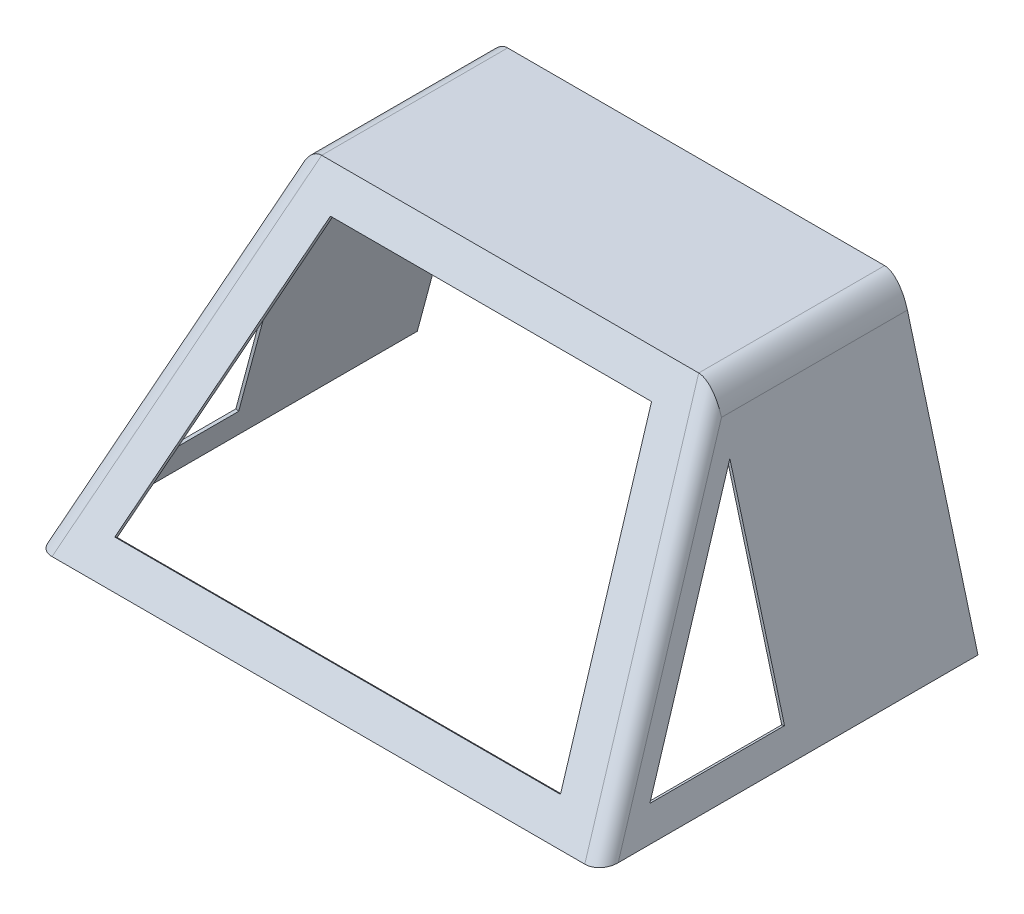
ISO-10303-21;
HEADER;
FILE_DESCRIPTION(('STEP AP214'),'2;1');
FILE_NAME('part.step','',(''),(''),'','','');
FILE_SCHEMA(('AUTOMOTIVE_DESIGN { 1 0 10303 214 1 1 1 1 }'));
ENDSEC;
DATA;
#1=APPLICATION_CONTEXT('core data for automotive mechanical design processes');
#2=APPLICATION_PROTOCOL_DEFINITION('international standard','automotive_design',2000,#1);
#3=PRODUCT_CONTEXT('',#1,'mechanical');
#4=PRODUCT('Part','Part','',(#3));
#5=PRODUCT_RELATED_PRODUCT_CATEGORY('part','',(#4));
#6=PRODUCT_DEFINITION_FORMATION('','',#4);
#7=PRODUCT_DEFINITION_CONTEXT('part definition',#1,'design');
#8=PRODUCT_DEFINITION('design','',#6,#7);
#9=PRODUCT_DEFINITION_SHAPE('','',#8);
#10=(LENGTH_UNIT() NAMED_UNIT(*) SI_UNIT(.MILLI.,.METRE.));
#11=(NAMED_UNIT(*) PLANE_ANGLE_UNIT() SI_UNIT($,.RADIAN.));
#12=(NAMED_UNIT(*) SI_UNIT($,.STERADIAN.) SOLID_ANGLE_UNIT());
#13=UNCERTAINTY_MEASURE_WITH_UNIT(LENGTH_MEASURE(1.E-05),#10,'distance_accuracy_value','');
#14=(GEOMETRIC_REPRESENTATION_CONTEXT(3) GLOBAL_UNCERTAINTY_ASSIGNED_CONTEXT((#13)) GLOBAL_UNIT_ASSIGNED_CONTEXT((#10,
#11,#12)) REPRESENTATION_CONTEXT('',''));
#15=CARTESIAN_POINT('',(0.,0.,0.));
#16=DIRECTION('',(0.,0.,1.));
#17=DIRECTION('',(1.,0.,0.));
#18=AXIS2_PLACEMENT_3D('',#15,#16,#17);
#19=CARTESIAN_POINT('',(-299.757495317995,30.6681449846779,147.146218744679));
#20=DIRECTION('',(-0.258819045102521,-0.965925826289068,0.));
#21=DIRECTION('',(0.965925826289068,-0.258819045102521,0.));
#22=AXIS2_PLACEMENT_3D('',#19,#20,#21);
#23=PLANE('',#22);
#24=DIRECTION('',(0.,0.,1.));
#25=VECTOR('',#24,1.);
#26=CARTESIAN_POINT('',(-296.690680819527,29.8463945164774,73.5731093723394));
#27=LINE('',#26,#25);
#28=CARTESIAN_POINT('',(-296.690680819527,29.8463945164774,0.));
#29=VERTEX_POINT('',#28);
#30=CARTESIAN_POINT('',(-296.690680819527,29.8463945164774,147.146218744679));
#31=VERTEX_POINT('',#30);
#32=EDGE_CURVE('E33',#29,#31,#27,.T.);
#33=ORIENTED_EDGE('',*,*,#32,.F.);
#34=DIRECTION('',(0.965925826289068,-0.258819045102521,0.));
#35=VECTOR('',#34,1.);
#36=CARTESIAN_POINT('',(-299.757495317995,30.6681449846779,0.));
#37=LINE('',#36,#35);
#38=CARTESIAN_POINT('',(-299.757495317995,30.6681449846779,0.));
#39=VERTEX_POINT('',#38);
#40=EDGE_CURVE('E578',#39,#29,#37,.T.);
#41=ORIENTED_EDGE('',*,*,#40,.F.);
#42=DIRECTION('',(0.,0.,-1.));
#43=VECTOR('',#42,1.);
#44=CARTESIAN_POINT('',(-299.757495317995,30.6681449846779,73.5731093723394));
#45=LINE('',#44,#43);
#46=CARTESIAN_POINT('',(-299.757495317995,30.6681449846779,147.146218744679));
#47=VERTEX_POINT('',#46);
#48=EDGE_CURVE('E580',#47,#39,#45,.T.);
#49=ORIENTED_EDGE('',*,*,#48,.F.);
#50=DIRECTION('',(0.965925826289068,-0.258819045102521,0.));
#51=VECTOR('',#50,1.);
#52=CARTESIAN_POINT('',(-299.757495317995,30.6681449846779,147.146218744679));
#53=LINE('',#52,#51);
#54=EDGE_CURVE('E9',#47,#31,#53,.T.);
#55=ORIENTED_EDGE('',*,*,#54,.T.);
#56=EDGE_LOOP('',(#33,#41,#49,#55));
#57=FACE_BOUND('',#56,.T.);
#58=ADVANCED_FACE('F15',(#57),#23,.F.);
#59=CARTESIAN_POINT('',(-240.018540042344,253.616961264494,0.));
#60=DIRECTION('',(0.139131791088288,0.519246913289549,0.843222976292653));
#61=DIRECTION('',(0.,-0.851504819811608,0.524346776320406));
#62=AXIS2_PLACEMENT_3D('',#59,#60,#61);
#63=PLANE('',#62);
#64=DIRECTION('',(0.21824216553257,0.814490850121409,-0.53756396108013));
#65=VECTOR('',#64,1.);
#66=CARTESIAN_POINT('',(-261.111096098265,162.631212408428,59.5082389359915));
#67=LINE('',#66,#65);
#68=CARTESIAN_POINT('',(-236.951725543876,252.795210796294,0.));
#69=VERTEX_POINT('',#68);
#70=EDGE_CURVE('E478',#31,#69,#67,.T.);
#71=ORIENTED_EDGE('',*,*,#70,.F.);
#72=ORIENTED_EDGE('',*,*,#54,.F.);
#73=DIRECTION('',(-0.21824216553257,-0.814490850121409,0.53756396108013));
#74=VECTOR('',#73,1.);
#75=CARTESIAN_POINT('',(-264.177910596733,163.452962876629,59.5082389359915));
#76=LINE('',#75,#74);
#77=CARTESIAN_POINT('',(-240.018540042344,253.616961264494,0.));
#78=VERTEX_POINT('',#77);
#79=EDGE_CURVE('E222',#78,#47,#76,.T.);
#80=ORIENTED_EDGE('',*,*,#79,.F.);
#81=DIRECTION('',(0.965925826289068,-0.258819045102521,0.));
#82=VECTOR('',#81,1.);
#83=CARTESIAN_POINT('',(-240.018540042344,253.616961264494,0.));
#84=LINE('',#83,#82);
#85=EDGE_CURVE('E25',#78,#69,#84,.T.);
#86=ORIENTED_EDGE('',*,*,#85,.T.);
#87=EDGE_LOOP('',(#71,#72,#80,#86));
#88=FACE_BOUND('',#87,.T.);
#89=ADVANCED_FACE('F283',(#88),#63,.F.);
#90=CARTESIAN_POINT('',(-299.757495317995,30.6681449846779,0.));
#91=DIRECTION('',(0.,0.,-1.));
#92=DIRECTION('',(0.,1.,0.));
#93=AXIS2_PLACEMENT_3D('',#90,#91,#92);
#94=PLANE('',#93);
#95=DIRECTION('',(-0.25881904510252,-0.965925826289068,0.));
#96=VECTOR('',#95,1.);
#97=CARTESIAN_POINT('',(-300.79943316053,14.5123220241384,0.));
#98=LINE('',#97,#96);
#99=EDGE_CURVE('E573',#69,#29,#98,.T.);
#100=ORIENTED_EDGE('',*,*,#99,.F.);
#101=ORIENTED_EDGE('',*,*,#85,.F.);
#102=DIRECTION('',(0.25881904510252,0.965925826289068,0.));
#103=VECTOR('',#102,1.);
#104=CARTESIAN_POINT('',(-303.866247658998,15.3340724923389,0.));
#105=LINE('',#104,#103);
#106=EDGE_CURVE('E441',#39,#78,#105,.T.);
#107=ORIENTED_EDGE('',*,*,#106,.F.);
#108=ORIENTED_EDGE('',*,*,#40,.T.);
#109=EDGE_LOOP('',(#100,#101,#107,#108));
#110=FACE_BOUND('',#109,.T.);
#111=ADVANCED_FACE('F240',(#110),#94,.F.);
#112=CARTESIAN_POINT('',(299.757495317995,30.6681449846779,0.));
#113=DIRECTION('',(0.,0.,-1.));
#114=DIRECTION('',(0.,1.,0.));
#115=AXIS2_PLACEMENT_3D('',#112,#113,#114);
#116=PLANE('',#115);
#117=DIRECTION('',(-0.25881904510252,0.965925826289068,0.));
#118=VECTOR('',#117,1.);
#119=CARTESIAN_POINT('',(258.262498862089,173.262322024138,0.));
#120=LINE('',#119,#118);
#121=CARTESIAN_POINT('',(296.690680819527,29.8463945164774,0.));
#122=VERTEX_POINT('',#121);
#123=CARTESIAN_POINT('',(236.951725543876,252.795210796294,0.));
#124=VERTEX_POINT('',#123);
#125=EDGE_CURVE('E361',#122,#124,#120,.T.);
#126=ORIENTED_EDGE('',*,*,#125,.F.);
#127=DIRECTION('',(-0.965925826289068,-0.258819045102521,0.));
#128=VECTOR('',#127,1.);
#129=CARTESIAN_POINT('',(299.757495317995,30.6681449846779,0.));
#130=LINE('',#129,#128);
#131=CARTESIAN_POINT('',(299.757495317995,30.6681449846779,0.));
#132=VERTEX_POINT('',#131);
#133=EDGE_CURVE('E363',#132,#122,#130,.T.);
#134=ORIENTED_EDGE('',*,*,#133,.F.);
#135=DIRECTION('',(0.25881904510252,-0.965925826289068,0.));
#136=VECTOR('',#135,1.);
#137=CARTESIAN_POINT('',(261.329313360557,174.084072492339,0.));
#138=LINE('',#137,#136);
#139=CARTESIAN_POINT('',(240.018540042344,253.616961264494,0.));
#140=VERTEX_POINT('',#139);
#141=EDGE_CURVE('E220',#140,#132,#138,.T.);
#142=ORIENTED_EDGE('',*,*,#141,.F.);
#143=DIRECTION('',(-0.965925826289068,-0.258819045102521,0.));
#144=VECTOR('',#143,1.);
#145=CARTESIAN_POINT('',(240.018540042344,253.616961264494,0.));
#146=LINE('',#145,#144);
#147=EDGE_CURVE('E366',#140,#124,#146,.T.);
#148=ORIENTED_EDGE('',*,*,#147,.T.);
#149=EDGE_LOOP('',(#126,#134,#142,#148));
#150=FACE_BOUND('',#149,.T.);
#151=ADVANCED_FACE('F351',(#150),#116,.F.);
#152=CARTESIAN_POINT('',(240.018540042344,253.616961264494,0.));
#153=DIRECTION('',(-0.139131791088288,0.519246913289549,0.843222976292653));
#154=DIRECTION('',(0.,-0.851504819811608,0.524346776320406));
#155=AXIS2_PLACEMENT_3D('',#152,#153,#154);
#156=PLANE('',#155);
#157=DIRECTION('',(0.21824216553257,-0.814490850121409,0.53756396108013));
#158=VECTOR('',#157,1.);
#159=CARTESIAN_POINT('',(230.866272909886,275.506429213398,-14.9894041552885));
#160=LINE('',#159,#158);
#161=CARTESIAN_POINT('',(296.690680819527,29.8463945164774,147.146218744679));
#162=VERTEX_POINT('',#161);
#163=EDGE_CURVE('E378',#124,#162,#160,.T.);
#164=ORIENTED_EDGE('',*,*,#163,.F.);
#165=ORIENTED_EDGE('',*,*,#147,.F.);
#166=DIRECTION('',(-0.21824216553257,0.814490850121409,-0.53756396108013));
#167=VECTOR('',#166,1.);
#168=CARTESIAN_POINT('',(233.933087408354,276.328179681598,-14.9894041552885));
#169=LINE('',#168,#167);
#170=CARTESIAN_POINT('',(299.757495317995,30.6681449846779,147.146218744679));
#171=VERTEX_POINT('',#170);
#172=EDGE_CURVE('E509',#171,#140,#169,.T.);
#173=ORIENTED_EDGE('',*,*,#172,.F.);
#174=DIRECTION('',(-0.965925826289068,-0.258819045102521,0.));
#175=VECTOR('',#174,1.);
#176=CARTESIAN_POINT('',(299.757495317995,30.6681449846779,147.146218744679));
#177=LINE('',#176,#175);
#178=EDGE_CURVE('E374',#171,#162,#177,.T.);
#179=ORIENTED_EDGE('',*,*,#178,.T.);
#180=EDGE_LOOP('',(#164,#165,#173,#179));
#181=FACE_BOUND('',#180,.T.);
#182=ADVANCED_FACE('F347',(#181),#156,.F.);
#183=CARTESIAN_POINT('',(299.757495317995,30.6681449846779,147.146218744679));
#184=DIRECTION('',(0.258819045102521,-0.965925826289068,0.));
#185=DIRECTION('',(0.965925826289068,0.258819045102521,0.));
#186=AXIS2_PLACEMENT_3D('',#183,#184,#185);
#187=PLANE('',#186);
#188=DIRECTION('',(0.,0.,-1.));
#189=VECTOR('',#188,1.);
#190=CARTESIAN_POINT('',(296.690680819527,29.8463945164774,73.5731093723395));
#191=LINE('',#190,#189);
#192=EDGE_CURVE('E369',#162,#122,#191,.T.);
#193=ORIENTED_EDGE('',*,*,#192,.F.);
#194=ORIENTED_EDGE('',*,*,#178,.F.);
#195=DIRECTION('',(0.,0.,1.));
#196=VECTOR('',#195,1.);
#197=CARTESIAN_POINT('',(299.757495317995,30.6681449846779,73.5731093723395));
#198=LINE('',#197,#196);
#199=EDGE_CURVE('E216',#132,#171,#198,.T.);
#200=ORIENTED_EDGE('',*,*,#199,.F.);
#201=ORIENTED_EDGE('',*,*,#133,.T.);
#202=EDGE_LOOP('',(#193,#194,#200,#201));
#203=FACE_BOUND('',#202,.T.);
#204=ADVANCED_FACE('F343',(#203),#187,.F.);
#205=CARTESIAN_POINT('',(-243.50321171992,31.7986183900017,188.562911862599));
#206=DIRECTION('',(0.,-0.834609406561725,0.550842208330739));
#207=DIRECTION('',(0.,-0.550842208330739,-0.834609406561725));
#208=AXIS2_PLACEMENT_3D('',#205,#206,#207);
#209=PLANE('',#208);
#210=DIRECTION('',(1.,0.,0.));
#211=VECTOR('',#210,1.);
#212=CARTESIAN_POINT('',(-233.202171561519,30.0496943785516,185.913026996765));
#213=LINE('',#212,#211);
#214=CARTESIAN_POINT('',(-243.50321171992,30.0496943785516,185.913026996765));
#215=VERTEX_POINT('',#214);
#216=CARTESIAN_POINT('',(243.50321171992,30.0496943785517,185.913026996765));
#217=VERTEX_POINT('',#216);
#218=EDGE_CURVE('E386',#215,#217,#213,.T.);
#219=ORIENTED_EDGE('',*,*,#218,.F.);
#220=DIRECTION('',(0.,-0.550842208330739,-0.834609406561725));
#221=VECTOR('',#220,1.);
#222=CARTESIAN_POINT('',(-243.50321171992,31.7986183900017,188.562911862599));
#223=LINE('',#222,#221);
#224=CARTESIAN_POINT('',(-243.50321171992,31.7986183900017,188.562911862599));
#225=VERTEX_POINT('',#224);
#226=EDGE_CURVE('E390',#225,#215,#223,.T.);
#227=ORIENTED_EDGE('',*,*,#226,.F.);
#228=DIRECTION('',(-1.,0.,0.));
#229=VECTOR('',#228,1.);
#230=CARTESIAN_POINT('',(-233.202171561519,31.7986183900017,188.562911862599));
#231=LINE('',#230,#229);
#232=CARTESIAN_POINT('',(243.50321171992,31.7986183900018,188.562911862599));
#233=VERTEX_POINT('',#232);
#234=EDGE_CURVE('E395',#233,#225,#231,.T.);
#235=ORIENTED_EDGE('',*,*,#234,.F.);
#236=DIRECTION('',(0.,-0.550842208330739,-0.834609406561725));
#237=VECTOR('',#236,1.);
#238=CARTESIAN_POINT('',(243.50321171992,31.7986183900018,188.562911862599));
#239=LINE('',#238,#237);
#240=EDGE_CURVE('E375',#233,#217,#239,.T.);
#241=ORIENTED_EDGE('',*,*,#240,.T.);
#242=EDGE_LOOP('',(#219,#227,#235,#241));
#243=FACE_BOUND('',#242,.T.);
#244=ADVANCED_FACE('F339',(#243),#209,.F.);
#245=CARTESIAN_POINT('',(243.50321171992,31.7986183900018,188.562911862599));
#246=DIRECTION('',(0.975894644510182,0.182146964261884,-0.120216996412843));
#247=DIRECTION('',(-0.183477610215909,0.983023889104156,0.));
#248=AXIS2_PLACEMENT_3D('',#245,#246,#247);
#249=PLANE('',#248);
#250=DIRECTION('',(-0.21824216553257,0.814490850121409,-0.53756396108013));
#251=VECTOR('',#250,1.);
#252=CARTESIAN_POINT('',(195.942255191614,207.549600598765,68.7630888914244));
#253=LINE('',#252,#251);
#254=CARTESIAN_POINT('',(175.470171359091,283.952457598548,18.3372032715676));
#255=VERTEX_POINT('',#254);
#256=EDGE_CURVE('E389',#217,#255,#253,.T.);
#257=ORIENTED_EDGE('',*,*,#256,.F.);
#258=ORIENTED_EDGE('',*,*,#240,.F.);
#259=DIRECTION('',(0.21824216553257,-0.814490850121409,0.53756396108013));
#260=VECTOR('',#259,1.);
#261=CARTESIAN_POINT('',(195.942255191614,209.298524610215,71.4129737572579));
#262=LINE('',#261,#260);
#263=CARTESIAN_POINT('',(175.470171359091,285.701381609998,20.9870881374011));
#264=VERTEX_POINT('',#263);
#265=EDGE_CURVE('E397',#264,#233,#262,.T.);
#266=ORIENTED_EDGE('',*,*,#265,.F.);
#267=DIRECTION('',(0.,-0.550842208330739,-0.834609406561725));
#268=VECTOR('',#267,1.);
#269=CARTESIAN_POINT('',(175.470171359091,285.701381609998,20.9870881374011));
#270=LINE('',#269,#268);
#271=EDGE_CURVE('E401',#264,#255,#270,.T.);
#272=ORIENTED_EDGE('',*,*,#271,.T.);
#273=EDGE_LOOP('',(#257,#258,#266,#272));
#274=FACE_BOUND('',#273,.T.);
#275=ADVANCED_FACE('F335',(#274),#249,.F.);
#276=CARTESIAN_POINT('',(175.470171359091,285.701381609998,20.9870881374011));
#277=DIRECTION('',(0.,0.834609406561725,-0.550842208330739));
#278=DIRECTION('',(0.,0.550842208330739,0.834609406561725));
#279=AXIS2_PLACEMENT_3D('',#276,#277,#278);
#280=PLANE('',#279);
#281=DIRECTION('',(-1.,0.,0.));
#282=VECTOR('',#281,1.);
#283=CARTESIAN_POINT('',(-23.7154800220137,283.952457598548,18.3372032715677));
#284=LINE('',#283,#282);
#285=CARTESIAN_POINT('',(-175.470171359091,283.952457598548,18.3372032715677));
#286=VERTEX_POINT('',#285);
#287=EDGE_CURVE('E409',#255,#286,#284,.T.);
#288=ORIENTED_EDGE('',*,*,#287,.F.);
#289=ORIENTED_EDGE('',*,*,#271,.F.);
#290=DIRECTION('',(1.,0.,0.));
#291=VECTOR('',#290,1.);
#292=CARTESIAN_POINT('',(-23.7154800220137,285.701381609998,20.9870881374011));
#293=LINE('',#292,#291);
#294=CARTESIAN_POINT('',(-175.470171359091,285.701381609998,20.9870881374012));
#295=VERTEX_POINT('',#294);
#296=EDGE_CURVE('E406',#295,#264,#293,.T.);
#297=ORIENTED_EDGE('',*,*,#296,.F.);
#298=DIRECTION('',(0.,-0.550842208330739,-0.834609406561725));
#299=VECTOR('',#298,1.);
#300=CARTESIAN_POINT('',(-175.470171359091,285.701381609998,20.9870881374012));
#301=LINE('',#300,#299);
#302=EDGE_CURVE('E393',#295,#286,#301,.T.);
#303=ORIENTED_EDGE('',*,*,#302,.T.);
#304=EDGE_LOOP('',(#288,#289,#297,#303));
#305=FACE_BOUND('',#304,.T.);
#306=ADVANCED_FACE('F331',(#305),#280,.F.);
#307=CARTESIAN_POINT('',(-175.470171359091,285.701381609998,20.9870881374012));
#308=DIRECTION('',(-0.975894644510182,0.182146964261884,-0.120216996412843));
#309=DIRECTION('',(-0.183477610215909,-0.983023889104156,0.));
#310=AXIS2_PLACEMENT_3D('',#307,#308,#309);
#311=PLANE('',#310);
#312=DIRECTION('',(-0.21824216553257,-0.814490850121409,0.53756396108013));
#313=VECTOR('',#312,1.);
#314=CARTESIAN_POINT('',(-172.542436283289,294.878913652543,11.1257422759311));
#315=LINE('',#314,#313);
#316=EDGE_CURVE('E388',#286,#215,#315,.T.);
#317=ORIENTED_EDGE('',*,*,#316,.F.);
#318=ORIENTED_EDGE('',*,*,#302,.F.);
#319=DIRECTION('',(0.21824216553257,0.814490850121409,-0.53756396108013));
#320=VECTOR('',#319,1.);
#321=CARTESIAN_POINT('',(-172.542436283289,296.627837663993,13.7756271417646));
#322=LINE('',#321,#320);
#323=EDGE_CURVE('E398',#225,#295,#322,.T.);
#324=ORIENTED_EDGE('',*,*,#323,.F.);
#325=ORIENTED_EDGE('',*,*,#226,.T.);
#326=EDGE_LOOP('',(#317,#318,#324,#325));
#327=FACE_BOUND('',#326,.T.);
#328=ADVANCED_FACE('F238',(#327),#311,.F.);
#329=CARTESIAN_POINT('',(212.445716005578,282.916593514631,0.));
#330=DIRECTION('',(0.,0.,-1.));
#331=DIRECTION('',(-0.25881904510252,0.965925826289068,0.));
#332=AXIS2_PLACEMENT_3D('',#329,#330,#331);
#333=ELLIPSE('',#332,35.437643479155,19.05);
#334=DIRECTION('',(0.,0.,-1.));
#335=VECTOR('',#334,1.);
#336=SURFACE_OF_LINEAR_EXTRUSION('',#333,#335);
#337=CARTESIAN_POINT('',(212.445716005578,282.916593514631,-203.2));
#338=DIRECTION('',(0.,0.,1.));
#339=DIRECTION('',(-0.25881904510252,0.965925826289068,0.));
#340=AXIS2_PLACEMENT_3D('',#337,#338,#339);
#341=ELLIPSE('',#340,35.437643479155,19.05);
#342=CARTESIAN_POINT('',(230.846602996385,287.847096323834,-203.2));
#343=VERTEX_POINT('',#342);
#344=CARTESIAN_POINT('',(205.990856825255,317.5,-203.2));
#345=VERTEX_POINT('',#344);
#346=EDGE_CURVE('E394',#343,#345,#341,.T.);
#347=ORIENTED_EDGE('',*,*,#346,.T.);
#348=DIRECTION('',(0.,0.,-1.));
#349=VECTOR('',#348,1.);
#350=CARTESIAN_POINT('',(205.990856825255,317.5,0.));
#351=LINE('',#350,#349);
#352=CARTESIAN_POINT('',(205.990856825255,317.5,0.));
#353=VERTEX_POINT('',#352);
#354=EDGE_CURVE('E423',#353,#345,#351,.T.);
#355=ORIENTED_EDGE('',*,*,#354,.F.);
#356=CARTESIAN_POINT('',(212.445716005578,282.916593514631,0.));
#357=DIRECTION('',(0.,0.,1.));
#358=DIRECTION('',(-0.25881904510252,0.965925826289068,0.));
#359=AXIS2_PLACEMENT_3D('',#356,#357,#358);
#360=ELLIPSE('',#359,35.437643479155,19.05);
#361=CARTESIAN_POINT('',(230.846602996385,287.847096323834,0.));
#362=VERTEX_POINT('',#361);
#363=EDGE_CURVE('E205',#362,#353,#360,.T.);
#364=ORIENTED_EDGE('',*,*,#363,.F.);
#365=DIRECTION('',(0.,0.,-1.));
#366=VECTOR('',#365,1.);
#367=CARTESIAN_POINT('',(230.846602996385,287.847096323834,0.));
#368=LINE('',#367,#366);
#369=EDGE_CURVE('E203',#362,#343,#368,.T.);
#370=ORIENTED_EDGE('',*,*,#369,.T.);
#371=EDGE_LOOP('',(#347,#355,#364,#370));
#372=FACE_BOUND('',#371,.T.);
#373=ADVANCED_FACE('F233',(#372),#336,.T.);
#374=CARTESIAN_POINT('',(205.990856825255,317.5,0.));
#375=DIRECTION('',(0.,1.,0.));
#376=DIRECTION('',(0.,0.,1.));
#377=AXIS2_PLACEMENT_3D('',#374,#375,#376);
#378=PLANE('',#377);
#379=DIRECTION('',(-1.,0.,0.));
#380=VECTOR('',#379,1.);
#381=CARTESIAN_POINT('',(-205.990856825255,317.5,-203.2));
#382=LINE('',#381,#380);
#383=CARTESIAN_POINT('',(-205.990856825255,317.5,-203.2));
#384=VERTEX_POINT('',#383);
#385=EDGE_CURVE('E429',#345,#384,#382,.T.);
#386=ORIENTED_EDGE('',*,*,#385,.T.);
#387=DIRECTION('',(0.,0.,-1.));
#388=VECTOR('',#387,1.);
#389=CARTESIAN_POINT('',(-205.990856825255,317.5,0.));
#390=LINE('',#389,#388);
#391=CARTESIAN_POINT('',(-205.990856825255,317.5,0.));
#392=VERTEX_POINT('',#391);
#393=EDGE_CURVE('E432',#392,#384,#390,.T.);
#394=ORIENTED_EDGE('',*,*,#393,.F.);
#395=DIRECTION('',(1.,0.,0.));
#396=VECTOR('',#395,1.);
#397=CARTESIAN_POINT('',(-222.901131403119,317.5,0.));
#398=LINE('',#397,#396);
#399=EDGE_CURVE('E425',#392,#353,#398,.T.);
#400=ORIENTED_EDGE('',*,*,#399,.T.);
#401=ORIENTED_EDGE('',*,*,#354,.T.);
#402=EDGE_LOOP('',(#386,#394,#400,#401));
#403=FACE_BOUND('',#402,.T.);
#404=ADVANCED_FACE('F237',(#403),#378,.T.);
#405=CARTESIAN_POINT('',(-212.445716005578,282.916593514631,0.));
#406=DIRECTION('',(0.,0.,-1.));
#407=DIRECTION('',(0.25881904510252,0.965925826289069,0.));
#408=AXIS2_PLACEMENT_3D('',#405,#406,#407);
#409=ELLIPSE('',#408,35.437643479155,19.05);
#410=DIRECTION('',(0.,0.,-1.));
#411=VECTOR('',#410,1.);
#412=SURFACE_OF_LINEAR_EXTRUSION('',#409,#411);
#413=CARTESIAN_POINT('',(-212.445716005578,282.916593514631,-203.2));
#414=DIRECTION('',(0.,0.,1.));
#415=DIRECTION('',(0.25881904510252,0.965925826289069,0.));
#416=AXIS2_PLACEMENT_3D('',#413,#414,#415);
#417=ELLIPSE('',#416,35.437643479155,19.05);
#418=CARTESIAN_POINT('',(-230.846602996385,287.847096323834,-203.2));
#419=VERTEX_POINT('',#418);
#420=EDGE_CURVE('E426',#384,#419,#417,.T.);
#421=ORIENTED_EDGE('',*,*,#420,.T.);
#422=DIRECTION('',(0.,0.,-1.));
#423=VECTOR('',#422,1.);
#424=CARTESIAN_POINT('',(-230.846602996385,287.847096323834,0.));
#425=LINE('',#424,#423);
#426=CARTESIAN_POINT('',(-230.846602996385,287.847096323834,0.));
#427=VERTEX_POINT('',#426);
#428=EDGE_CURVE('E439',#427,#419,#425,.T.);
#429=ORIENTED_EDGE('',*,*,#428,.F.);
#430=CARTESIAN_POINT('',(-212.445716005578,282.916593514631,0.));
#431=DIRECTION('',(0.,0.,1.));
#432=DIRECTION('',(0.25881904510252,0.965925826289069,0.));
#433=AXIS2_PLACEMENT_3D('',#430,#431,#432);
#434=ELLIPSE('',#433,35.437643479155,19.05);
#435=EDGE_CURVE('E442',#392,#427,#434,.T.);
#436=ORIENTED_EDGE('',*,*,#435,.F.);
#437=ORIENTED_EDGE('',*,*,#393,.T.);
#438=EDGE_LOOP('',(#421,#429,#436,#437));
#439=FACE_BOUND('',#438,.T.);
#440=ADVANCED_FACE('F246',(#439),#412,.T.);
#441=CARTESIAN_POINT('',(-212.445716005578,282.916593514631,0.));
#442=DIRECTION('',(0.,0.,-1.));
#443=DIRECTION('',(-0.25881904510252,-0.965925826289069,0.));
#444=AXIS2_PLACEMENT_3D('',#441,#442,#443);
#445=ELLIPSE('',#444,29.5313695659625,15.875);
#446=DIRECTION('',(0.,0.,-1.));
#447=VECTOR('',#446,1.);
#448=SURFACE_OF_LINEAR_EXTRUSION('',#445,#447);
#449=CARTESIAN_POINT('',(-212.445716005578,282.916593514631,-203.2));
#450=DIRECTION('',(0.,0.,-1.));
#451=DIRECTION('',(-0.25881904510252,-0.965925826289069,0.));
#452=AXIS2_PLACEMENT_3D('',#449,#450,#451);
#453=ELLIPSE('',#452,29.5313695659625,15.875);
#454=CARTESIAN_POINT('',(-227.779788497917,287.025345855634,-203.2));
#455=VERTEX_POINT('',#454);
#456=CARTESIAN_POINT('',(-207.066666688642,311.736098919105,-203.2));
#457=VERTEX_POINT('',#456);
#458=EDGE_CURVE('E434',#455,#457,#453,.T.);
#459=ORIENTED_EDGE('',*,*,#458,.T.);
#460=DIRECTION('',(0.,0.,-1.));
#461=VECTOR('',#460,1.);
#462=CARTESIAN_POINT('',(-207.066666688642,311.736098919105,0.));
#463=LINE('',#462,#461);
#464=CARTESIAN_POINT('',(-207.066666688643,311.736098919105,0.));
#465=VERTEX_POINT('',#464);
#466=EDGE_CURVE('E449',#465,#457,#463,.T.);
#467=ORIENTED_EDGE('',*,*,#466,.F.);
#468=CARTESIAN_POINT('',(-212.445716005578,282.916593514631,0.));
#469=DIRECTION('',(0.,0.,1.));
#470=DIRECTION('',(0.25881904510252,0.965925826289069,0.));
#471=AXIS2_PLACEMENT_3D('',#468,#469,#470);
#472=ELLIPSE('',#471,29.5313695659625,15.875);
#473=CARTESIAN_POINT('',(-227.779788497917,287.025345855634,0.));
#474=VERTEX_POINT('',#473);
#475=EDGE_CURVE('E448',#465,#474,#472,.T.);
#476=ORIENTED_EDGE('',*,*,#475,.T.);
#477=DIRECTION('',(0.,0.,-1.));
#478=VECTOR('',#477,1.);
#479=CARTESIAN_POINT('',(-227.779788497917,287.025345855634,0.));
#480=LINE('',#479,#478);
#481=EDGE_CURVE('E455',#474,#455,#480,.T.);
#482=ORIENTED_EDGE('',*,*,#481,.T.);
#483=EDGE_LOOP('',(#459,#467,#476,#482));
#484=FACE_BOUND('',#483,.T.);
#485=ADVANCED_FACE('F242',(#484),#448,.F.);
#486=CARTESIAN_POINT('',(-207.066666688642,311.736098919105,0.));
#487=DIRECTION('',(0.,-1.,0.));
#488=DIRECTION('',(1.,0.,0.));
#489=AXIS2_PLACEMENT_3D('',#486,#487,#488);
#490=PLANE('',#489);
#491=DIRECTION('',(1.,0.,0.));
#492=VECTOR('',#491,1.);
#493=CARTESIAN_POINT('',(207.066666688642,311.736098919105,-203.2));
#494=LINE('',#493,#492);
#495=CARTESIAN_POINT('',(207.066666688642,311.736098919105,-203.2));
#496=VERTEX_POINT('',#495);
#497=EDGE_CURVE('E457',#457,#496,#494,.T.);
#498=ORIENTED_EDGE('',*,*,#497,.T.);
#499=DIRECTION('',(0.,0.,-1.));
#500=VECTOR('',#499,1.);
#501=CARTESIAN_POINT('',(207.066666688642,311.736098919105,0.));
#502=LINE('',#501,#500);
#503=CARTESIAN_POINT('',(207.066666688642,311.736098919105,0.));
#504=VERTEX_POINT('',#503);
#505=EDGE_CURVE('E460',#504,#496,#502,.T.);
#506=ORIENTED_EDGE('',*,*,#505,.F.);
#507=DIRECTION('',(-1.,0.,0.));
#508=VECTOR('',#507,1.);
#509=CARTESIAN_POINT('',(-111.450565701559,311.736098919105,0.));
#510=LINE('',#509,#508);
#511=EDGE_CURVE('E451',#504,#465,#510,.T.);
#512=ORIENTED_EDGE('',*,*,#511,.T.);
#513=ORIENTED_EDGE('',*,*,#466,.T.);
#514=EDGE_LOOP('',(#498,#506,#512,#513));
#515=FACE_BOUND('',#514,.T.);
#516=ADVANCED_FACE('F245',(#515),#490,.T.);
#517=CARTESIAN_POINT('',(212.445716005578,282.916593514631,0.));
#518=DIRECTION('',(0.,0.,-1.));
#519=DIRECTION('',(0.25881904510252,-0.965925826289069,0.));
#520=AXIS2_PLACEMENT_3D('',#517,#518,#519);
#521=ELLIPSE('',#520,29.5313695659625,15.875);
#522=DIRECTION('',(0.,0.,-1.));
#523=VECTOR('',#522,1.);
#524=SURFACE_OF_LINEAR_EXTRUSION('',#521,#523);
#525=CARTESIAN_POINT('',(212.445716005578,282.916593514631,-203.2));
#526=DIRECTION('',(0.,0.,-1.));
#527=DIRECTION('',(0.25881904510252,-0.965925826289069,0.));
#528=AXIS2_PLACEMENT_3D('',#525,#526,#527);
#529=ELLIPSE('',#528,29.5313695659625,15.875);
#530=CARTESIAN_POINT('',(227.779788497917,287.025345855634,-203.2));
#531=VERTEX_POINT('',#530);
#532=EDGE_CURVE('E452',#496,#531,#529,.T.);
#533=ORIENTED_EDGE('',*,*,#532,.T.);
#534=DIRECTION('',(0.,0.,-1.));
#535=VECTOR('',#534,1.);
#536=CARTESIAN_POINT('',(227.779788497917,287.025345855634,0.));
#537=LINE('',#536,#535);
#538=CARTESIAN_POINT('',(227.779788497917,287.025345855634,0.));
#539=VERTEX_POINT('',#538);
#540=EDGE_CURVE('E468',#539,#531,#537,.T.);
#541=ORIENTED_EDGE('',*,*,#540,.F.);
#542=CARTESIAN_POINT('',(212.445716005578,282.916593514631,0.));
#543=DIRECTION('',(0.,0.,1.));
#544=DIRECTION('',(-0.25881904510252,0.965925826289069,0.));
#545=AXIS2_PLACEMENT_3D('',#542,#543,#544);
#546=ELLIPSE('',#545,29.5313695659625,15.875);
#547=EDGE_CURVE('E462',#539,#504,#546,.T.);
#548=ORIENTED_EDGE('',*,*,#547,.T.);
#549=ORIENTED_EDGE('',*,*,#505,.T.);
#550=EDGE_LOOP('',(#533,#541,#548,#549));
#551=FACE_BOUND('',#550,.T.);
#552=ADVANCED_FACE('F251',(#551),#524,.F.);
#553=CARTESIAN_POINT('',(0.,219.379826114573,-203.2));
#554=DIRECTION('',(0.,0.,1.));
#555=DIRECTION('',(1.,0.,0.));
#556=AXIS2_PLACEMENT_3D('',#553,#554,#555);
#557=PLANE('',#556);
#558=DIRECTION('',(1.,0.,0.));
#559=VECTOR('',#558,1.);
#560=CARTESIAN_POINT('',(307.975,0.,-203.2));
#561=LINE('',#560,#559);
#562=CARTESIAN_POINT('',(304.687998127198,0.,-203.2));
#563=VERTEX_POINT('',#562);
#564=CARTESIAN_POINT('',(307.975,0.,-203.2));
#565=VERTEX_POINT('',#564);
#566=EDGE_CURVE('E215',#563,#565,#561,.T.);
#567=ORIENTED_EDGE('',*,*,#566,.F.);
#568=DIRECTION('',(0.25881904510252,-0.965925826289068,0.));
#569=VECTOR('',#568,1.);
#570=CARTESIAN_POINT('',(304.687998127198,0.,-203.2));
#571=LINE('',#570,#569);
#572=EDGE_CURVE('E470',#531,#563,#571,.T.);
#573=ORIENTED_EDGE('',*,*,#572,.F.);
#574=ORIENTED_EDGE('',*,*,#532,.F.);
#575=ORIENTED_EDGE('',*,*,#497,.F.);
#576=ORIENTED_EDGE('',*,*,#458,.F.);
#577=DIRECTION('',(0.25881904510252,0.965925826289068,0.));
#578=VECTOR('',#577,1.);
#579=CARTESIAN_POINT('',(-227.779788497917,287.025345855634,-203.2));
#580=LINE('',#579,#578);
#581=CARTESIAN_POINT('',(-304.687998127198,0.,-203.2));
#582=VERTEX_POINT('',#581);
#583=EDGE_CURVE('E479',#582,#455,#580,.T.);
#584=ORIENTED_EDGE('',*,*,#583,.F.);
#585=DIRECTION('',(1.,0.,0.));
#586=VECTOR('',#585,1.);
#587=CARTESIAN_POINT('',(-304.687998127198,0.,-203.2));
#588=LINE('',#587,#586);
#589=CARTESIAN_POINT('',(-307.975,0.,-203.2));
#590=VERTEX_POINT('',#589);
#591=EDGE_CURVE('E475',#590,#582,#588,.T.);
#592=ORIENTED_EDGE('',*,*,#591,.F.);
#593=DIRECTION('',(-0.25881904510252,-0.965925826289068,0.));
#594=VECTOR('',#593,1.);
#595=CARTESIAN_POINT('',(-307.975,0.,-203.2));
#596=LINE('',#595,#594);
#597=EDGE_CURVE('E228',#419,#590,#596,.T.);
#598=ORIENTED_EDGE('',*,*,#597,.F.);
#599=ORIENTED_EDGE('',*,*,#420,.F.);
#600=ORIENTED_EDGE('',*,*,#385,.F.);
#601=ORIENTED_EDGE('',*,*,#346,.F.);
#602=DIRECTION('',(-0.25881904510252,0.965925826289069,0.));
#603=VECTOR('',#602,1.);
#604=CARTESIAN_POINT('',(230.846602996385,287.847096323834,-203.2));
#605=LINE('',#604,#603);
#606=EDGE_CURVE('E217',#565,#343,#605,.T.);
#607=ORIENTED_EDGE('',*,*,#606,.F.);
#608=EDGE_LOOP('',(#567,#573,#574,#575,#576,#584,#592,#598,#599,#600,#601,#607));
#609=FACE_BOUND('',#608,.T.);
#610=ADVANCED_FACE('F255',(#609),#557,.F.);
#611=CARTESIAN_POINT('',(-303.837259441229,3.17499999999999,0.));
#612=DIRECTION('',(0.,1.,0.));
#613=DIRECTION('',(-1.,0.,0.));
#614=AXIS2_PLACEMENT_3D('',#611,#612,#613);
#615=PLANE('',#614);
#616=CARTESIAN_POINT('',(-287.402250077219,3.17499999999999,184.629451719657));
#617=DIRECTION('',(0.,1.,0.));
#618=DIRECTION('',(-0.376165189670379,0.,0.926552615926504));
#619=AXIS2_PLACEMENT_3D('',#616,#617,#618);
#620=ELLIPSE('',#619,19.4907039135353,15.875);
#621=CARTESIAN_POINT('',(-303.837259441229,3.17499999999999,187.341228264718));
#622=VERTEX_POINT('',#621);
#623=CARTESIAN_POINT('',(-301.373181192352,3.17500000000003,196.85));
#624=VERTEX_POINT('',#623);
#625=EDGE_CURVE('E463',#622,#624,#620,.T.);
#626=ORIENTED_EDGE('',*,*,#625,.T.);
#627=DIRECTION('',(1.,0.,0.));
#628=VECTOR('',#627,1.);
#629=CARTESIAN_POINT('',(-303.837259441229,3.17499999999999,196.85));
#630=LINE('',#629,#628);
#631=CARTESIAN_POINT('',(-303.837259441229,3.17499999999999,196.85));
#632=VERTEX_POINT('',#631);
#633=EDGE_CURVE('E490',#632,#624,#630,.T.);
#634=ORIENTED_EDGE('',*,*,#633,.F.);
#635=DIRECTION('',(0.,0.,1.));
#636=VECTOR('',#635,1.);
#637=CARTESIAN_POINT('',(-303.837259441229,3.17499999999999,0.));
#638=LINE('',#637,#636);
#639=EDGE_CURVE('E482',#622,#632,#638,.T.);
#640=ORIENTED_EDGE('',*,*,#639,.F.);
#641=EDGE_LOOP('',(#626,#634,#640));
#642=FACE_BOUND('',#641,.T.);
#643=ADVANCED_FACE('F315',(#642),#615,.F.);
#644=CARTESIAN_POINT('',(-303.837259441229,3.17499999999999,0.));
#645=DIRECTION('',(0.,1.,0.));
#646=DIRECTION('',(-1.,0.,0.));
#647=AXIS2_PLACEMENT_3D('',#644,#645,#646);
#648=PLANE('',#647);
#649=CARTESIAN_POINT('',(287.402250077219,3.17500000000003,184.629451719657));
#650=DIRECTION('',(0.,1.,0.));
#651=DIRECTION('',(0.376165189670379,0.,0.926552615926504));
#652=AXIS2_PLACEMENT_3D('',#649,#650,#651);
#653=ELLIPSE('',#652,19.4907039135353,15.875);
#654=CARTESIAN_POINT('',(301.373181192352,3.1750000000001,196.85));
#655=VERTEX_POINT('',#654);
#656=CARTESIAN_POINT('',(303.837259441229,3.17499999999998,187.341228264718));
#657=VERTEX_POINT('',#656);
#658=EDGE_CURVE('E489',#655,#657,#653,.T.);
#659=ORIENTED_EDGE('',*,*,#658,.T.);
#660=DIRECTION('',(0.,0.,1.));
#661=VECTOR('',#660,1.);
#662=CARTESIAN_POINT('',(303.837259441229,3.175,0.));
#663=LINE('',#662,#661);
#664=CARTESIAN_POINT('',(303.837259441229,3.175,196.85));
#665=VERTEX_POINT('',#664);
#666=EDGE_CURVE('E499',#657,#665,#663,.T.);
#667=ORIENTED_EDGE('',*,*,#666,.T.);
#668=DIRECTION('',(1.,0.,0.));
#669=VECTOR('',#668,1.);
#670=CARTESIAN_POINT('',(-303.837259441229,3.17499999999999,196.85));
#671=LINE('',#670,#669);
#672=EDGE_CURVE('E494',#655,#665,#671,.T.);
#673=ORIENTED_EDGE('',*,*,#672,.F.);
#674=EDGE_LOOP('',(#659,#667,#673));
#675=FACE_BOUND('',#674,.T.);
#676=ADVANCED_FACE('F311',(#675),#648,.F.);
#677=CARTESIAN_POINT('',(0.,1.58529254560016,196.85));
#678=DIRECTION('',(0.,0.,1.));
#679=DIRECTION('',(1.,0.,0.));
#680=AXIS2_PLACEMENT_3D('',#677,#678,#679);
#681=PLANE('',#680);
#682=DIRECTION('',(0.258819045102524,-0.965925826289067,0.));
#683=VECTOR('',#682,1.);
#684=CARTESIAN_POINT('',(303.837259441229,3.175,196.85));
#685=LINE('',#684,#683);
#686=CARTESIAN_POINT('',(304.687998127198,0.,196.85));
#687=VERTEX_POINT('',#686);
#688=EDGE_CURVE('E502',#665,#687,#685,.T.);
#689=ORIENTED_EDGE('',*,*,#688,.T.);
#690=DIRECTION('',(1.,0.,0.));
#691=VECTOR('',#690,1.);
#692=CARTESIAN_POINT('',(0.,0.,196.85));
#693=LINE('',#692,#691);
#694=CARTESIAN_POINT('',(-304.687998127198,0.,196.85));
#695=VERTEX_POINT('',#694);
#696=EDGE_CURVE('E507',#695,#687,#693,.T.);
#697=ORIENTED_EDGE('',*,*,#696,.F.);
#698=DIRECTION('',(0.258819045102515,0.96592582628907,0.));
#699=VECTOR('',#698,1.);
#700=CARTESIAN_POINT('',(-304.687998127198,0.,196.85));
#701=LINE('',#700,#699);
#702=EDGE_CURVE('E493',#695,#632,#701,.T.);
#703=ORIENTED_EDGE('',*,*,#702,.T.);
#704=ORIENTED_EDGE('',*,*,#633,.T.);
#705=DIRECTION('',(-1.,0.,0.));
#706=VECTOR('',#705,1.);
#707=CARTESIAN_POINT('',(0.,3.175,196.85));
#708=LINE('',#707,#706);
#709=EDGE_CURVE('E504',#655,#624,#708,.T.);
#710=ORIENTED_EDGE('',*,*,#709,.F.);
#711=ORIENTED_EDGE('',*,*,#672,.T.);
#712=EDGE_LOOP('',(#689,#697,#703,#704,#710,#711));
#713=FACE_BOUND('',#712,.T.);
#714=ADVANCED_FACE('F307',(#713),#681,.F.);
#715=CARTESIAN_POINT('',(0.,3.175,104.775));
#716=DIRECTION('',(0.,1.,0.));
#717=DIRECTION('',(0.,0.,1.));
#718=AXIS2_PLACEMENT_3D('',#715,#716,#717);
#719=PLANE('',#718);
#720=ORIENTED_EDGE('',*,*,#709,.T.);
#721=CARTESIAN_POINT('',(-287.402250077219,3.17499999999999,184.629451719657));
#722=DIRECTION('',(0.,1.,0.));
#723=DIRECTION('',(-0.376165189670379,0.,0.926552615926504));
#724=AXIS2_PLACEMENT_3D('',#721,#722,#723);
#725=ELLIPSE('',#724,19.4907039135353,15.875);
#726=CARTESIAN_POINT('',(-289.745363959676,3.17499999999999,203.650325286609));
#727=VERTEX_POINT('',#726);
#728=EDGE_CURVE('E513',#624,#727,#725,.T.);
#729=ORIENTED_EDGE('',*,*,#728,.T.);
#730=DIRECTION('',(1.,0.,0.));
#731=VECTOR('',#730,1.);
#732=CARTESIAN_POINT('',(-111.450565701559,3.17499999999999,203.650325286609));
#733=LINE('',#732,#731);
#734=CARTESIAN_POINT('',(289.745363959676,3.17500000000001,203.650325286609));
#735=VERTEX_POINT('',#734);
#736=EDGE_CURVE('E516',#727,#735,#733,.T.);
#737=ORIENTED_EDGE('',*,*,#736,.T.);
#738=CARTESIAN_POINT('',(287.402250077219,3.17500000000003,184.629451719657));
#739=DIRECTION('',(0.,1.,0.));
#740=DIRECTION('',(0.376165189670379,0.,0.926552615926504));
#741=AXIS2_PLACEMENT_3D('',#738,#739,#740);
#742=ELLIPSE('',#741,19.4907039135353,15.875);
#743=EDGE_CURVE('E411',#735,#655,#742,.T.);
#744=ORIENTED_EDGE('',*,*,#743,.T.);
#745=EDGE_LOOP('',(#720,#729,#737,#744));
#746=FACE_BOUND('',#745,.T.);
#747=ADVANCED_FACE('F261',(#746),#719,.T.);
#748=CARTESIAN_POINT('',(-237.041110351705,191.125332182695,60.5822324790779));
#749=DIRECTION('',(-0.21824216553257,-0.814490850121409,0.53756396108013));
#750=DIRECTION('',(-0.965925826289069,0.25881904510252,0.));
#751=AXIS2_PLACEMENT_3D('',#748,#749,#750);
#752=CYLINDRICAL_SURFACE('',#751,15.875);
#753=ORIENTED_EDGE('',*,*,#625,.F.);
#754=DIRECTION('',(-0.21824216553257,-0.814490850121409,0.53756396108013));
#755=VECTOR('',#754,1.);
#756=CARTESIAN_POINT('',(-252.375182844044,195.234084523698,60.5822324790779));
#757=LINE('',#756,#755);
#758=EDGE_CURVE('E496',#474,#622,#757,.T.);
#759=ORIENTED_EDGE('',*,*,#758,.F.);
#760=ORIENTED_EDGE('',*,*,#475,.F.);
#761=DIRECTION('',(0.21824216553257,0.814490850121409,-0.53756396108013));
#762=VECTOR('',#761,1.);
#763=CARTESIAN_POINT('',(-237.041110351705,199.869952239946,73.8316568082453));
#764=LINE('',#763,#762);
#765=EDGE_CURVE('E403',#727,#465,#764,.T.);
#766=ORIENTED_EDGE('',*,*,#765,.F.);
#767=ORIENTED_EDGE('',*,*,#728,.F.);
#768=EDGE_LOOP('',(#753,#759,#760,#766,#767));
#769=FACE_BOUND('',#768,.T.);
#770=ADVANCED_FACE('F257',(#769),#752,.F.);
#771=CARTESIAN_POINT('',(-222.901131403119,315.75107598855,-2.64988486583348));
#772=DIRECTION('',(0.,-0.550842208330739,-0.834609406561725));
#773=DIRECTION('',(0.,0.834609406561725,-0.550842208330739));
#774=AXIS2_PLACEMENT_3D('',#771,#772,#773);
#775=PLANE('',#774);
#776=ORIENTED_EDGE('',*,*,#287,.T.);
#777=ORIENTED_EDGE('',*,*,#316,.T.);
#778=ORIENTED_EDGE('',*,*,#218,.T.);
#779=ORIENTED_EDGE('',*,*,#256,.T.);
#780=EDGE_LOOP('',(#776,#777,#778,#779));
#781=FACE_BOUND('',#780,.T.);
#782=ORIENTED_EDGE('',*,*,#765,.T.);
#783=ORIENTED_EDGE('',*,*,#511,.F.);
#784=DIRECTION('',(0.21824216553257,-0.814490850121409,0.53756396108013));
#785=VECTOR('',#784,1.);
#786=CARTESIAN_POINT('',(196.179585891235,352.367237601136,-26.8165515301403));
#787=LINE('',#786,#785);
#788=EDGE_CURVE('E381',#504,#735,#787,.T.);
#789=ORIENTED_EDGE('',*,*,#788,.T.);
#790=ORIENTED_EDGE('',*,*,#736,.F.);
#791=EDGE_LOOP('',(#782,#783,#789,#790));
#792=FACE_BOUND('',#791,.T.);
#793=ADVANCED_FACE('F260',(#781,#792),#775,.T.);
#794=CARTESIAN_POINT('',(196.179585891235,343.622617543885,-40.0659758593077));
#795=DIRECTION('',(0.21824216553257,-0.814490850121409,0.53756396108013));
#796=DIRECTION('',(-0.965925826289069,-0.25881904510252,0.));
#797=AXIS2_PLACEMENT_3D('',#794,#795,#796);
#798=CYLINDRICAL_SURFACE('',#797,15.875);
#799=ORIENTED_EDGE('',*,*,#743,.F.);
#800=ORIENTED_EDGE('',*,*,#788,.F.);
#801=ORIENTED_EDGE('',*,*,#547,.F.);
#802=DIRECTION('',(-0.21824216553257,0.814490850121409,-0.53756396108013));
#803=VECTOR('',#802,1.);
#804=CARTESIAN_POINT('',(211.513658383574,347.731369884888,-40.0659758593077));
#805=LINE('',#804,#803);
#806=EDGE_CURVE('E370',#657,#539,#805,.T.);
#807=ORIENTED_EDGE('',*,*,#806,.F.);
#808=ORIENTED_EDGE('',*,*,#658,.F.);
#809=EDGE_LOOP('',(#799,#800,#801,#807,#808));
#810=FACE_BOUND('',#809,.T.);
#811=ADVANCED_FACE('F263',(#810),#798,.F.);
#812=CARTESIAN_POINT('',(219.834316904651,316.6782495318,0.));
#813=DIRECTION('',(-0.965925826289068,-0.25881904510252,0.));
#814=DIRECTION('',(0.25881904510252,-0.965925826289068,0.));
#815=AXIS2_PLACEMENT_3D('',#812,#813,#814);
#816=PLANE('',#815);
#817=ORIENTED_EDGE('',*,*,#163,.T.);
#818=ORIENTED_EDGE('',*,*,#192,.T.);
#819=ORIENTED_EDGE('',*,*,#125,.T.);
#820=EDGE_LOOP('',(#817,#818,#819));
#821=FACE_BOUND('',#820,.T.);
#822=ORIENTED_EDGE('',*,*,#806,.T.);
#823=ORIENTED_EDGE('',*,*,#540,.T.);
#824=ORIENTED_EDGE('',*,*,#572,.T.);
#825=DIRECTION('',(0.,0.,-1.));
#826=VECTOR('',#825,1.);
#827=CARTESIAN_POINT('',(304.687998127198,0.,52.3875));
#828=LINE('',#827,#826);
#829=EDGE_CURVE('E474',#687,#563,#828,.T.);
#830=ORIENTED_EDGE('',*,*,#829,.F.);
#831=ORIENTED_EDGE('',*,*,#688,.F.);
#832=ORIENTED_EDGE('',*,*,#666,.F.);
#833=EDGE_LOOP('',(#822,#823,#824,#830,#831,#832));
#834=FACE_BOUND('',#833,.T.);
#835=ADVANCED_FACE('F265',(#821,#834),#816,.T.);
#836=CARTESIAN_POINT('',(-304.908185501532,-0.821750468200508,0.));
#837=DIRECTION('',(0.965925826289068,-0.25881904510252,0.));
#838=DIRECTION('',(0.25881904510252,0.965925826289068,0.));
#839=AXIS2_PLACEMENT_3D('',#836,#837,#838);
#840=PLANE('',#839);
#841=ORIENTED_EDGE('',*,*,#70,.T.);
#842=ORIENTED_EDGE('',*,*,#99,.T.);
#843=ORIENTED_EDGE('',*,*,#32,.T.);
#844=EDGE_LOOP('',(#841,#842,#843));
#845=FACE_BOUND('',#844,.T.);
#846=ORIENTED_EDGE('',*,*,#758,.T.);
#847=ORIENTED_EDGE('',*,*,#639,.T.);
#848=ORIENTED_EDGE('',*,*,#702,.F.);
#849=DIRECTION('',(0.,0.,1.));
#850=VECTOR('',#849,1.);
#851=CARTESIAN_POINT('',(-304.687998127198,0.,52.3875));
#852=LINE('',#851,#850);
#853=EDGE_CURVE('E485',#582,#695,#852,.T.);
#854=ORIENTED_EDGE('',*,*,#853,.F.);
#855=ORIENTED_EDGE('',*,*,#583,.T.);
#856=ORIENTED_EDGE('',*,*,#481,.F.);
#857=EDGE_LOOP('',(#846,#847,#848,#854,#855,#856));
#858=FACE_BOUND('',#857,.T.);
#859=ADVANCED_FACE('F270',(#845,#858),#840,.T.);
#860=CARTESIAN_POINT('',(-237.041110351705,191.125332182695,60.5822324790779));
#861=DIRECTION('',(-0.21824216553257,-0.814490850121409,0.53756396108013));
#862=DIRECTION('',(-0.965925826289069,0.25881904510252,0.));
#863=AXIS2_PLACEMENT_3D('',#860,#861,#862);
#864=CYLINDRICAL_SURFACE('',#863,19.05);
#865=CARTESIAN_POINT('',(-288.252988763188,0.,186.724951719657));
#866=DIRECTION('',(0.,1.,0.));
#867=DIRECTION('',(-0.376165189670379,0.,0.926552615926504));
#868=AXIS2_PLACEMENT_3D('',#865,#866,#867);
#869=ELLIPSE('',#868,23.3888446962423,19.05);
#870=CARTESIAN_POINT('',(-307.975,0.,189.979083573731));
#871=VERTEX_POINT('',#870);
#872=CARTESIAN_POINT('',(-291.064725422137,0.,209.55));
#873=VERTEX_POINT('',#872);
#874=EDGE_CURVE('E483',#871,#873,#869,.T.);
#875=ORIENTED_EDGE('',*,*,#874,.T.);
#876=DIRECTION('',(0.21824216553257,0.814490850121409,-0.53756396108013));
#877=VECTOR('',#876,1.);
#878=CARTESIAN_POINT('',(-237.041110351705,201.618876251396,76.4815416740788));
#879=LINE('',#878,#877);
#880=EDGE_CURVE('E445',#873,#392,#879,.T.);
#881=ORIENTED_EDGE('',*,*,#880,.T.);
#882=ORIENTED_EDGE('',*,*,#435,.T.);
#883=DIRECTION('',(-0.21824216553257,-0.814490850121409,0.53756396108013));
#884=VECTOR('',#883,1.);
#885=CARTESIAN_POINT('',(-255.441997342511,196.055834991898,60.5822324790779));
#886=LINE('',#885,#884);
#887=EDGE_CURVE('E414',#427,#871,#886,.T.);
#888=ORIENTED_EDGE('',*,*,#887,.T.);
#889=EDGE_LOOP('',(#875,#881,#882,#888));
#890=FACE_BOUND('',#889,.T.);
#891=ADVANCED_FACE('F267',(#890),#864,.T.);
#892=CARTESIAN_POINT('',(-222.901131403119,317.5,0.));
#893=DIRECTION('',(0.,-0.550842208330739,-0.834609406561725));
#894=DIRECTION('',(0.,0.834609406561725,-0.550842208330739));
#895=AXIS2_PLACEMENT_3D('',#892,#893,#894);
#896=PLANE('',#895);
#897=ORIENTED_EDGE('',*,*,#296,.T.);
#898=ORIENTED_EDGE('',*,*,#265,.T.);
#899=ORIENTED_EDGE('',*,*,#234,.T.);
#900=ORIENTED_EDGE('',*,*,#323,.T.);
#901=EDGE_LOOP('',(#897,#898,#899,#900));
#902=FACE_BOUND('',#901,.T.);
#903=ORIENTED_EDGE('',*,*,#880,.F.);
#904=DIRECTION('',(1.,0.,0.));
#905=VECTOR('',#904,1.);
#906=CARTESIAN_POINT('',(-307.975,0.,209.55));
#907=LINE('',#906,#905);
#908=CARTESIAN_POINT('',(291.064725422137,0.,209.55));
#909=VERTEX_POINT('',#908);
#910=EDGE_CURVE('E210',#873,#909,#907,.T.);
#911=ORIENTED_EDGE('',*,*,#910,.T.);
#912=DIRECTION('',(0.21824216553257,-0.814490850121409,0.53756396108013));
#913=VECTOR('',#912,1.);
#914=CARTESIAN_POINT('',(196.179585891235,354.116161612586,-24.1666666643068));
#915=LINE('',#914,#913);
#916=EDGE_CURVE('E191',#353,#909,#915,.T.);
#917=ORIENTED_EDGE('',*,*,#916,.F.);
#918=ORIENTED_EDGE('',*,*,#399,.F.);
#919=EDGE_LOOP('',(#903,#911,#917,#918));
#920=FACE_BOUND('',#919,.T.);
#921=ADVANCED_FACE('F269',(#902,#920),#896,.F.);
#922=CARTESIAN_POINT('',(196.179585891235,343.622617543885,-40.0659758593077));
#923=DIRECTION('',(0.21824216553257,-0.814490850121409,0.53756396108013));
#924=DIRECTION('',(-0.965925826289069,-0.25881904510252,0.));
#925=AXIS2_PLACEMENT_3D('',#922,#923,#924);
#926=CYLINDRICAL_SURFACE('',#925,19.05);
#927=CARTESIAN_POINT('',(288.252988763188,0.,186.724951719657));
#928=DIRECTION('',(0.,1.,0.));
#929=DIRECTION('',(0.37616518967038,0.,0.926552615926504));
#930=AXIS2_PLACEMENT_3D('',#927,#928,#929);
#931=ELLIPSE('',#930,23.3888446962423,19.05);
#932=CARTESIAN_POINT('',(307.975,0.,189.979083573731));
#933=VERTEX_POINT('',#932);
#934=EDGE_CURVE('E204',#909,#933,#931,.T.);
#935=ORIENTED_EDGE('',*,*,#934,.T.);
#936=DIRECTION('',(-0.21824216553257,0.814490850121409,-0.53756396108013));
#937=VECTOR('',#936,1.);
#938=CARTESIAN_POINT('',(214.580472882042,348.553120353088,-40.0659758593077));
#939=LINE('',#938,#937);
#940=EDGE_CURVE('E198',#933,#362,#939,.T.);
#941=ORIENTED_EDGE('',*,*,#940,.T.);
#942=ORIENTED_EDGE('',*,*,#363,.T.);
#943=ORIENTED_EDGE('',*,*,#916,.T.);
#944=EDGE_LOOP('',(#935,#941,#942,#943));
#945=FACE_BOUND('',#944,.T.);
#946=ADVANCED_FACE('F17',(#945),#926,.T.);
#947=CARTESIAN_POINT('',(0.,0.,104.775));
#948=DIRECTION('',(0.,1.,0.));
#949=DIRECTION('',(0.,0.,1.));
#950=AXIS2_PLACEMENT_3D('',#947,#948,#949);
#951=PLANE('',#950);
#952=ORIENTED_EDGE('',*,*,#829,.T.);
#953=ORIENTED_EDGE('',*,*,#566,.T.);
#954=DIRECTION('',(0.,0.,-1.));
#955=VECTOR('',#954,1.);
#956=CARTESIAN_POINT('',(307.975,0.,0.));
#957=LINE('',#956,#955);
#958=EDGE_CURVE('E202',#933,#565,#957,.T.);
#959=ORIENTED_EDGE('',*,*,#958,.F.);
#960=ORIENTED_EDGE('',*,*,#934,.F.);
#961=ORIENTED_EDGE('',*,*,#910,.F.);
#962=ORIENTED_EDGE('',*,*,#874,.F.);
#963=DIRECTION('',(0.,0.,1.));
#964=VECTOR('',#963,1.);
#965=CARTESIAN_POINT('',(-307.975,0.,0.));
#966=LINE('',#965,#964);
#967=EDGE_CURVE('E225',#590,#871,#966,.T.);
#968=ORIENTED_EDGE('',*,*,#967,.F.);
#969=ORIENTED_EDGE('',*,*,#591,.T.);
#970=ORIENTED_EDGE('',*,*,#853,.T.);
#971=ORIENTED_EDGE('',*,*,#696,.T.);
#972=EDGE_LOOP('',(#952,#953,#959,#960,#961,#962,#968,#969,#970,#971));
#973=FACE_BOUND('',#972,.T.);
#974=ADVANCED_FACE('F214',(#973),#951,.F.);
#975=CARTESIAN_POINT('',(222.901131403119,317.5,0.));
#976=DIRECTION('',(-0.965925826289068,-0.25881904510252,0.));
#977=DIRECTION('',(0.25881904510252,-0.965925826289068,0.));
#978=AXIS2_PLACEMENT_3D('',#975,#976,#977);
#979=PLANE('',#978);
#980=ORIENTED_EDGE('',*,*,#172,.T.);
#981=ORIENTED_EDGE('',*,*,#141,.T.);
#982=ORIENTED_EDGE('',*,*,#199,.T.);
#983=EDGE_LOOP('',(#980,#981,#982));
#984=FACE_BOUND('',#983,.T.);
#985=ORIENTED_EDGE('',*,*,#940,.F.);
#986=ORIENTED_EDGE('',*,*,#958,.T.);
#987=ORIENTED_EDGE('',*,*,#606,.T.);
#988=ORIENTED_EDGE('',*,*,#369,.F.);
#989=EDGE_LOOP('',(#985,#986,#987,#988));
#990=FACE_BOUND('',#989,.T.);
#991=ADVANCED_FACE('F199',(#984,#990),#979,.F.);
#992=CARTESIAN_POINT('',(-307.975,0.,0.));
#993=DIRECTION('',(0.965925826289068,-0.25881904510252,0.));
#994=DIRECTION('',(0.25881904510252,0.965925826289068,0.));
#995=AXIS2_PLACEMENT_3D('',#992,#993,#994);
#996=PLANE('',#995);
#997=ORIENTED_EDGE('',*,*,#79,.T.);
#998=ORIENTED_EDGE('',*,*,#48,.T.);
#999=ORIENTED_EDGE('',*,*,#106,.T.);
#1000=EDGE_LOOP('',(#997,#998,#999));
#1001=FACE_BOUND('',#1000,.T.);
#1002=ORIENTED_EDGE('',*,*,#887,.F.);
#1003=ORIENTED_EDGE('',*,*,#428,.T.);
#1004=ORIENTED_EDGE('',*,*,#597,.T.);
#1005=ORIENTED_EDGE('',*,*,#967,.T.);
#1006=EDGE_LOOP('',(#1002,#1003,#1004,#1005));
#1007=FACE_BOUND('',#1006,.T.);
#1008=ADVANCED_FACE('F290',(#1001,#1007),#996,.F.);
#1009=CLOSED_SHELL('',(#58,#89,#111,#151,#182,#204,#244,#275,#306,#328,#373,#404,#440,#485,#516,
#552,#610,#643,#676,#714,#747,#770,#793,#811,#835,#859,#891,#921,#946,#974,#991,#1008));
#1010=MANIFOLD_SOLID_BREP('B1',#1009);
#1011=ADVANCED_BREP_SHAPE_REPRESENTATION('',(#18,#1010),#14);
#1012=SHAPE_DEFINITION_REPRESENTATION(#9,#1011);
ENDSEC;
END-ISO-10303-21;
